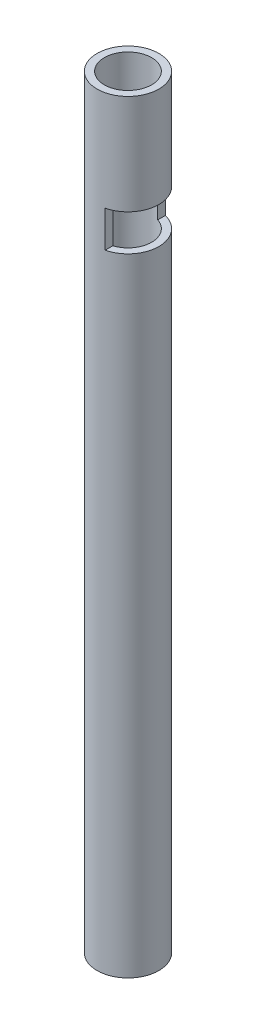
ISO-10303-21;
HEADER;
FILE_DESCRIPTION(('STEP AP214'),'2;1');
FILE_NAME('part.step','',(''),(''),'','','');
FILE_SCHEMA(('AUTOMOTIVE_DESIGN { 1 0 10303 214 1 1 1 1 }'));
ENDSEC;
DATA;
#1=APPLICATION_CONTEXT('core data for automotive mechanical design processes');
#2=APPLICATION_PROTOCOL_DEFINITION('international standard','automotive_design',2000,#1);
#3=PRODUCT_CONTEXT('',#1,'mechanical');
#4=PRODUCT('Part','Part','',(#3));
#5=PRODUCT_RELATED_PRODUCT_CATEGORY('part','',(#4));
#6=PRODUCT_DEFINITION_FORMATION('','',#4);
#7=PRODUCT_DEFINITION_CONTEXT('part definition',#1,'design');
#8=PRODUCT_DEFINITION('design','',#6,#7);
#9=PRODUCT_DEFINITION_SHAPE('','',#8);
#10=(LENGTH_UNIT() NAMED_UNIT(*) SI_UNIT(.MILLI.,.METRE.));
#11=(NAMED_UNIT(*) PLANE_ANGLE_UNIT() SI_UNIT($,.RADIAN.));
#12=(NAMED_UNIT(*) SI_UNIT($,.STERADIAN.) SOLID_ANGLE_UNIT());
#13=UNCERTAINTY_MEASURE_WITH_UNIT(LENGTH_MEASURE(1.E-05),#10,'distance_accuracy_value','');
#14=(GEOMETRIC_REPRESENTATION_CONTEXT(3) GLOBAL_UNCERTAINTY_ASSIGNED_CONTEXT((#13)) GLOBAL_UNIT_ASSIGNED_CONTEXT((#10,
#11,#12)) REPRESENTATION_CONTEXT('',''));
#15=CARTESIAN_POINT('',(0.,0.,0.));
#16=DIRECTION('',(0.,0.,1.));
#17=DIRECTION('',(1.,0.,0.));
#18=AXIS2_PLACEMENT_3D('',#15,#16,#17);
#19=CARTESIAN_POINT('',(0.,420.,0.));
#20=DIRECTION('',(0.,1.,0.));
#21=DIRECTION('',(0.,0.,1.));
#22=AXIS2_PLACEMENT_3D('',#19,#20,#21);
#23=PLANE('',#22);
#24=CARTESIAN_POINT('',(0.,420.,0.));
#25=DIRECTION('',(0.,1.,0.));
#26=DIRECTION('',(0.,0.,1.));
#27=AXIS2_PLACEMENT_3D('',#24,#25,#26);
#28=CIRCLE('',#27,17.);
#29=CARTESIAN_POINT('',(0.,420.,17.));
#30=VERTEX_POINT('',#29);
#31=EDGE_CURVE('E101',#30,#30,#28,.T.);
#32=ORIENTED_EDGE('',*,*,#31,.T.);
#33=EDGE_LOOP('',(#32));
#34=FACE_BOUND('',#33,.T.);
#35=CARTESIAN_POINT('',(0.,420.,0.));
#36=DIRECTION('',(0.,1.,0.));
#37=DIRECTION('',(0.,0.,1.));
#38=AXIS2_PLACEMENT_3D('',#35,#36,#37);
#39=CIRCLE('',#38,13.);
#40=CARTESIAN_POINT('',(0.,420.,13.));
#41=VERTEX_POINT('',#40);
#42=EDGE_CURVE('E93',#41,#41,#39,.T.);
#43=ORIENTED_EDGE('',*,*,#42,.F.);
#44=EDGE_LOOP('',(#43));
#45=FACE_BOUND('',#44,.T.);
#46=ADVANCED_FACE('F33',(#34,#45),#23,.T.);
#47=CARTESIAN_POINT('',(0.,0.,0.));
#48=DIRECTION('',(0.,1.,0.));
#49=DIRECTION('',(0.,0.,1.));
#50=AXIS2_PLACEMENT_3D('',#47,#48,#49);
#51=PLANE('',#50);
#52=CARTESIAN_POINT('',(0.,0.,0.));
#53=DIRECTION('',(0.,1.,0.));
#54=DIRECTION('',(0.,0.,1.));
#55=AXIS2_PLACEMENT_3D('',#52,#53,#54);
#56=CIRCLE('',#55,17.);
#57=CARTESIAN_POINT('',(0.,0.,17.));
#58=VERTEX_POINT('',#57);
#59=EDGE_CURVE('E99',#58,#58,#56,.T.);
#60=ORIENTED_EDGE('',*,*,#59,.F.);
#61=EDGE_LOOP('',(#60));
#62=FACE_BOUND('',#61,.T.);
#63=CARTESIAN_POINT('',(0.,0.,0.));
#64=DIRECTION('',(0.,1.,0.));
#65=DIRECTION('',(0.,0.,1.));
#66=AXIS2_PLACEMENT_3D('',#63,#64,#65);
#67=CIRCLE('',#66,13.);
#68=CARTESIAN_POINT('',(0.,0.,13.));
#69=VERTEX_POINT('',#68);
#70=EDGE_CURVE('E89',#69,#69,#67,.T.);
#71=ORIENTED_EDGE('',*,*,#70,.T.);
#72=EDGE_LOOP('',(#71));
#73=FACE_BOUND('',#72,.T.);
#74=ADVANCED_FACE('F127',(#62,#73),#51,.F.);
#75=CARTESIAN_POINT('',(0.,420.,0.));
#76=DIRECTION('',(0.,-1.,0.));
#77=DIRECTION('',(0.,0.,-1.));
#78=AXIS2_PLACEMENT_3D('',#75,#76,#77);
#79=CYLINDRICAL_SURFACE('',#78,17.);
#80=DIRECTION('',(0.,-1.,0.));
#81=VECTOR('',#80,1.);
#82=CARTESIAN_POINT('',(4.00000000000005,420.,16.5227116418583));
#83=LINE('',#82,#81);
#84=CARTESIAN_POINT('',(4.,345.,16.5227116418583));
#85=VERTEX_POINT('',#84);
#86=CARTESIAN_POINT('',(4.00000000000001,365.,16.5227116418583));
#87=VERTEX_POINT('',#86);
#88=EDGE_CURVE('E90',#85,#87,#83,.F.);
#89=ORIENTED_EDGE('',*,*,#88,.T.);
#90=CARTESIAN_POINT('',(0.,365.,0.));
#91=DIRECTION('',(0.,1.,0.));
#92=DIRECTION('',(0.,0.,1.));
#93=AXIS2_PLACEMENT_3D('',#90,#91,#92);
#94=CIRCLE('',#93,17.);
#95=CARTESIAN_POINT('',(4.00000000000001,365.,-16.5227116418583));
#96=VERTEX_POINT('',#95);
#97=EDGE_CURVE('E75',#87,#96,#94,.T.);
#98=ORIENTED_EDGE('',*,*,#97,.T.);
#99=DIRECTION('',(0.,-1.,0.));
#100=VECTOR('',#99,1.);
#101=CARTESIAN_POINT('',(4.00000000000005,420.,-16.5227116418583));
#102=LINE('',#101,#100);
#103=CARTESIAN_POINT('',(4.,345.,-16.5227116418583));
#104=VERTEX_POINT('',#103);
#105=EDGE_CURVE('E81',#96,#104,#102,.T.);
#106=ORIENTED_EDGE('',*,*,#105,.T.);
#107=CARTESIAN_POINT('',(0.,345.,0.));
#108=DIRECTION('',(0.,-1.,0.));
#109=DIRECTION('',(0.,0.,-1.));
#110=AXIS2_PLACEMENT_3D('',#107,#108,#109);
#111=CIRCLE('',#110,17.);
#112=EDGE_CURVE('E70',#104,#85,#111,.T.);
#113=ORIENTED_EDGE('',*,*,#112,.T.);
#114=EDGE_LOOP('',(#89,#98,#106,#113));
#115=FACE_BOUND('',#114,.T.);
#116=ORIENTED_EDGE('',*,*,#31,.F.);
#117=EDGE_LOOP('',(#116));
#118=FACE_BOUND('',#117,.T.);
#119=ORIENTED_EDGE('',*,*,#59,.T.);
#120=EDGE_LOOP('',(#119));
#121=FACE_BOUND('',#120,.T.);
#122=ADVANCED_FACE('F35',(#115,#118,#121),#79,.T.);
#123=CARTESIAN_POINT('',(0.,420.,0.));
#124=DIRECTION('',(0.,-1.,0.));
#125=DIRECTION('',(0.,0.,-1.));
#126=AXIS2_PLACEMENT_3D('',#123,#124,#125);
#127=CYLINDRICAL_SURFACE('',#126,13.);
#128=CARTESIAN_POINT('',(0.,365.,0.));
#129=DIRECTION('',(0.,1.,0.));
#130=DIRECTION('',(0.,0.,1.));
#131=AXIS2_PLACEMENT_3D('',#128,#129,#130);
#132=CIRCLE('',#131,13.);
#133=CARTESIAN_POINT('',(4.00000000000001,365.,12.369316876853));
#134=VERTEX_POINT('',#133);
#135=CARTESIAN_POINT('',(4.00000000000001,365.,-12.369316876853));
#136=VERTEX_POINT('',#135);
#137=EDGE_CURVE('E11',#134,#136,#132,.T.);
#138=ORIENTED_EDGE('',*,*,#137,.F.);
#139=DIRECTION('',(0.,-1.,0.));
#140=VECTOR('',#139,1.);
#141=CARTESIAN_POINT('',(4.00000000000005,420.,12.369316876853));
#142=LINE('',#141,#140);
#143=CARTESIAN_POINT('',(4.,345.,12.369316876853));
#144=VERTEX_POINT('',#143);
#145=EDGE_CURVE('E108',#144,#134,#142,.F.);
#146=ORIENTED_EDGE('',*,*,#145,.F.);
#147=CARTESIAN_POINT('',(0.,345.,0.));
#148=DIRECTION('',(0.,-1.,0.));
#149=DIRECTION('',(0.,0.,-1.));
#150=AXIS2_PLACEMENT_3D('',#147,#148,#149);
#151=CIRCLE('',#150,13.);
#152=CARTESIAN_POINT('',(4.,345.,-12.369316876853));
#153=VERTEX_POINT('',#152);
#154=EDGE_CURVE('E104',#153,#144,#151,.T.);
#155=ORIENTED_EDGE('',*,*,#154,.F.);
#156=DIRECTION('',(0.,-1.,0.));
#157=VECTOR('',#156,1.);
#158=CARTESIAN_POINT('',(4.00000000000005,420.,-12.369316876853));
#159=LINE('',#158,#157);
#160=EDGE_CURVE('E41',#136,#153,#159,.T.);
#161=ORIENTED_EDGE('',*,*,#160,.F.);
#162=EDGE_LOOP('',(#138,#146,#155,#161));
#163=FACE_BOUND('',#162,.T.);
#164=ORIENTED_EDGE('',*,*,#42,.T.);
#165=EDGE_LOOP('',(#164));
#166=FACE_BOUND('',#165,.T.);
#167=ORIENTED_EDGE('',*,*,#70,.F.);
#168=EDGE_LOOP('',(#167));
#169=FACE_BOUND('',#168,.T.);
#170=ADVANCED_FACE('F119',(#163,#166,#169),#127,.F.);
#171=CARTESIAN_POINT('',(4.,345.,-25.));
#172=DIRECTION('',(-1.,0.,0.));
#173=DIRECTION('',(0.,-1.,0.));
#174=AXIS2_PLACEMENT_3D('',#171,#172,#173);
#175=PLANE('',#174);
#176=DIRECTION('',(0.,0.,1.));
#177=VECTOR('',#176,1.);
#178=CARTESIAN_POINT('',(4.00000000000001,365.,-25.));
#179=LINE('',#178,#177);
#180=EDGE_CURVE('E76',#96,#136,#179,.T.);
#181=ORIENTED_EDGE('',*,*,#180,.T.);
#182=ORIENTED_EDGE('',*,*,#160,.T.);
#183=DIRECTION('',(0.,0.,1.));
#184=VECTOR('',#183,1.);
#185=CARTESIAN_POINT('',(4.,345.,-25.));
#186=LINE('',#185,#184);
#187=EDGE_CURVE('E53',#104,#153,#186,.T.);
#188=ORIENTED_EDGE('',*,*,#187,.F.);
#189=ORIENTED_EDGE('',*,*,#105,.F.);
#190=EDGE_LOOP('',(#181,#182,#188,#189));
#191=FACE_BOUND('',#190,.T.);
#192=ADVANCED_FACE('F80',(#191),#175,.F.);
#193=EDGE_CURVE('E48',#144,#85,#186,.T.);
#194=ORIENTED_EDGE('',*,*,#193,.F.);
#195=ORIENTED_EDGE('',*,*,#145,.T.);
#196=EDGE_CURVE('E85',#134,#87,#179,.T.);
#197=ORIENTED_EDGE('',*,*,#196,.T.);
#198=ORIENTED_EDGE('',*,*,#88,.F.);
#199=EDGE_LOOP('',(#194,#195,#197,#198));
#200=FACE_BOUND('',#199,.T.);
#201=ADVANCED_FACE('F113',(#200),#175,.F.);
#202=CARTESIAN_POINT('',(4.00000000000001,365.,-25.));
#203=DIRECTION('',(0.,1.,0.));
#204=DIRECTION('',(0.,0.,1.));
#205=AXIS2_PLACEMENT_3D('',#202,#203,#204);
#206=PLANE('',#205);
#207=ORIENTED_EDGE('',*,*,#196,.F.);
#208=ORIENTED_EDGE('',*,*,#137,.T.);
#209=ORIENTED_EDGE('',*,*,#180,.F.);
#210=ORIENTED_EDGE('',*,*,#97,.F.);
#211=EDGE_LOOP('',(#207,#208,#209,#210));
#212=FACE_BOUND('',#211,.T.);
#213=ADVANCED_FACE('F117',(#212),#206,.F.);
#214=CARTESIAN_POINT('',(4.,345.,-25.));
#215=DIRECTION('',(0.,-1.,0.));
#216=DIRECTION('',(0.,0.,-1.));
#217=AXIS2_PLACEMENT_3D('',#214,#215,#216);
#218=PLANE('',#217);
#219=ORIENTED_EDGE('',*,*,#187,.T.);
#220=ORIENTED_EDGE('',*,*,#154,.T.);
#221=ORIENTED_EDGE('',*,*,#193,.T.);
#222=ORIENTED_EDGE('',*,*,#112,.F.);
#223=EDGE_LOOP('',(#219,#220,#221,#222));
#224=FACE_BOUND('',#223,.T.);
#225=ADVANCED_FACE('F71',(#224),#218,.F.);
#226=CLOSED_SHELL('',(#46,#74,#122,#170,#192,#201,#213,#225));
#227=MANIFOLD_SOLID_BREP('B2',#226);
#228=ADVANCED_BREP_SHAPE_REPRESENTATION('',(#18,#227),#14);
#229=SHAPE_DEFINITION_REPRESENTATION(#9,#228);
ENDSEC;
END-ISO-10303-21;
